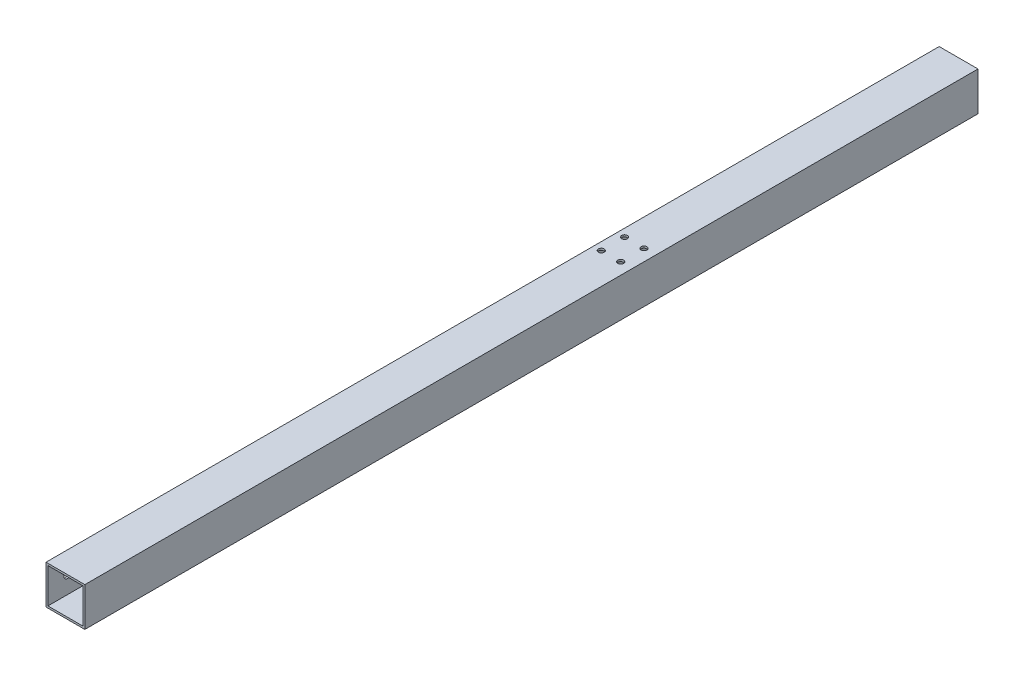
ISO-10303-21;
HEADER;
FILE_DESCRIPTION(('STEP AP214'),'2;1');
FILE_NAME('part.step','',(''),(''),'','','');
FILE_SCHEMA(('AUTOMOTIVE_DESIGN { 1 0 10303 214 1 1 1 1 }'));
ENDSEC;
DATA;
#1=APPLICATION_CONTEXT('core data for automotive mechanical design processes');
#2=APPLICATION_PROTOCOL_DEFINITION('international standard','automotive_design',2000,#1);
#3=PRODUCT_CONTEXT('',#1,'mechanical');
#4=PRODUCT('Part','Part','',(#3));
#5=PRODUCT_RELATED_PRODUCT_CATEGORY('part','',(#4));
#6=PRODUCT_DEFINITION_FORMATION('','',#4);
#7=PRODUCT_DEFINITION_CONTEXT('part definition',#1,'design');
#8=PRODUCT_DEFINITION('design','',#6,#7);
#9=PRODUCT_DEFINITION_SHAPE('','',#8);
#10=(LENGTH_UNIT() NAMED_UNIT(*) SI_UNIT(.MILLI.,.METRE.));
#11=(NAMED_UNIT(*) PLANE_ANGLE_UNIT() SI_UNIT($,.RADIAN.));
#12=(NAMED_UNIT(*) SI_UNIT($,.STERADIAN.) SOLID_ANGLE_UNIT());
#13=UNCERTAINTY_MEASURE_WITH_UNIT(LENGTH_MEASURE(1.E-05),#10,'distance_accuracy_value','');
#14=(GEOMETRIC_REPRESENTATION_CONTEXT(3) GLOBAL_UNCERTAINTY_ASSIGNED_CONTEXT((#13)) GLOBAL_UNIT_ASSIGNED_CONTEXT((#10,
#11,#12)) REPRESENTATION_CONTEXT('',''));
#15=CARTESIAN_POINT('',(0.,0.,0.));
#16=DIRECTION('',(0.,0.,1.));
#17=DIRECTION('',(1.,0.,0.));
#18=AXIS2_PLACEMENT_3D('',#15,#16,#17);
#19=CARTESIAN_POINT('',(0.,0.,460.));
#20=DIRECTION('',(0.,0.,1.));
#21=DIRECTION('',(1.,0.,0.));
#22=AXIS2_PLACEMENT_3D('',#19,#20,#21);
#23=PLANE('',#22);
#24=DIRECTION('',(0.,1.,0.));
#25=VECTOR('',#24,1.);
#26=CARTESIAN_POINT('',(10.,10.,460.));
#27=LINE('',#26,#25);
#28=CARTESIAN_POINT('',(10.,-10.,460.));
#29=VERTEX_POINT('',#28);
#30=CARTESIAN_POINT('',(10.,10.,460.));
#31=VERTEX_POINT('',#30);
#32=EDGE_CURVE('E143',#29,#31,#27,.T.);
#33=ORIENTED_EDGE('',*,*,#32,.T.);
#34=DIRECTION('',(-1.,0.,0.));
#35=VECTOR('',#34,1.);
#36=CARTESIAN_POINT('',(-10.,10.,460.));
#37=LINE('',#36,#35);
#38=CARTESIAN_POINT('',(-10.,10.,460.));
#39=VERTEX_POINT('',#38);
#40=EDGE_CURVE('E146',#31,#39,#37,.T.);
#41=ORIENTED_EDGE('',*,*,#40,.T.);
#42=DIRECTION('',(0.,-1.,0.));
#43=VECTOR('',#42,1.);
#44=CARTESIAN_POINT('',(-10.,10.,460.));
#45=LINE('',#44,#43);
#46=CARTESIAN_POINT('',(-10.,-10.,460.));
#47=VERTEX_POINT('',#46);
#48=EDGE_CURVE('E149',#39,#47,#45,.T.);
#49=ORIENTED_EDGE('',*,*,#48,.T.);
#50=DIRECTION('',(1.,0.,0.));
#51=VECTOR('',#50,1.);
#52=CARTESIAN_POINT('',(-10.,-10.,460.));
#53=LINE('',#52,#51);
#54=EDGE_CURVE('E151',#47,#29,#53,.T.);
#55=ORIENTED_EDGE('',*,*,#54,.T.);
#56=EDGE_LOOP('',(#33,#41,#49,#55));
#57=FACE_BOUND('',#56,.T.);
#58=DIRECTION('',(-1.,0.,0.));
#59=VECTOR('',#58,1.);
#60=CARTESIAN_POINT('',(-9.,9.,460.));
#61=LINE('',#60,#59);
#62=CARTESIAN_POINT('',(9.,9.,460.));
#63=VERTEX_POINT('',#62);
#64=CARTESIAN_POINT('',(-9.,9.,460.));
#65=VERTEX_POINT('',#64);
#66=EDGE_CURVE('E113',#63,#65,#61,.T.);
#67=ORIENTED_EDGE('',*,*,#66,.F.);
#68=DIRECTION('',(0.,1.,0.));
#69=VECTOR('',#68,1.);
#70=CARTESIAN_POINT('',(9.,9.,460.));
#71=LINE('',#70,#69);
#72=CARTESIAN_POINT('',(9.,-9.,460.));
#73=VERTEX_POINT('',#72);
#74=EDGE_CURVE('E105',#73,#63,#71,.T.);
#75=ORIENTED_EDGE('',*,*,#74,.F.);
#76=DIRECTION('',(1.,0.,0.));
#77=VECTOR('',#76,1.);
#78=CARTESIAN_POINT('',(-9.,-9.,460.));
#79=LINE('',#78,#77);
#80=CARTESIAN_POINT('',(-9.,-9.,460.));
#81=VERTEX_POINT('',#80);
#82=EDGE_CURVE('E127',#81,#73,#79,.T.);
#83=ORIENTED_EDGE('',*,*,#82,.F.);
#84=DIRECTION('',(0.,-1.,0.));
#85=VECTOR('',#84,1.);
#86=CARTESIAN_POINT('',(-9.,9.,460.));
#87=LINE('',#86,#85);
#88=EDGE_CURVE('E125',#65,#81,#87,.T.);
#89=ORIENTED_EDGE('',*,*,#88,.F.);
#90=EDGE_LOOP('',(#67,#75,#83,#89));
#91=FACE_BOUND('',#90,.T.);
#92=ADVANCED_FACE('F38',(#57,#91),#23,.T.);
#93=CARTESIAN_POINT('',(0.,0.,0.));
#94=DIRECTION('',(0.,0.,1.));
#95=DIRECTION('',(1.,0.,0.));
#96=AXIS2_PLACEMENT_3D('',#93,#94,#95);
#97=PLANE('',#96);
#98=DIRECTION('',(0.,1.,0.));
#99=VECTOR('',#98,1.);
#100=CARTESIAN_POINT('',(10.,10.,0.));
#101=LINE('',#100,#99);
#102=CARTESIAN_POINT('',(10.,-10.,0.));
#103=VERTEX_POINT('',#102);
#104=CARTESIAN_POINT('',(10.,10.,0.));
#105=VERTEX_POINT('',#104);
#106=EDGE_CURVE('E121',#103,#105,#101,.T.);
#107=ORIENTED_EDGE('',*,*,#106,.F.);
#108=DIRECTION('',(1.,0.,0.));
#109=VECTOR('',#108,1.);
#110=CARTESIAN_POINT('',(-10.,-10.,0.));
#111=LINE('',#110,#109);
#112=CARTESIAN_POINT('',(-10.,-10.,0.));
#113=VERTEX_POINT('',#112);
#114=EDGE_CURVE('E147',#113,#103,#111,.T.);
#115=ORIENTED_EDGE('',*,*,#114,.F.);
#116=DIRECTION('',(0.,-1.,0.));
#117=VECTOR('',#116,1.);
#118=CARTESIAN_POINT('',(-10.,10.,0.));
#119=LINE('',#118,#117);
#120=CARTESIAN_POINT('',(-10.,10.,0.));
#121=VERTEX_POINT('',#120);
#122=EDGE_CURVE('E158',#121,#113,#119,.T.);
#123=ORIENTED_EDGE('',*,*,#122,.F.);
#124=DIRECTION('',(-1.,0.,0.));
#125=VECTOR('',#124,1.);
#126=CARTESIAN_POINT('',(-10.,10.,0.));
#127=LINE('',#126,#125);
#128=EDGE_CURVE('E156',#105,#121,#127,.T.);
#129=ORIENTED_EDGE('',*,*,#128,.F.);
#130=EDGE_LOOP('',(#107,#115,#123,#129));
#131=FACE_BOUND('',#130,.T.);
#132=DIRECTION('',(0.,1.,0.));
#133=VECTOR('',#132,1.);
#134=CARTESIAN_POINT('',(9.,9.,0.));
#135=LINE('',#134,#133);
#136=CARTESIAN_POINT('',(9.,-9.,0.));
#137=VERTEX_POINT('',#136);
#138=CARTESIAN_POINT('',(9.,9.,0.));
#139=VERTEX_POINT('',#138);
#140=EDGE_CURVE('E63',#137,#139,#135,.T.);
#141=ORIENTED_EDGE('',*,*,#140,.T.);
#142=DIRECTION('',(-1.,0.,0.));
#143=VECTOR('',#142,1.);
#144=CARTESIAN_POINT('',(-9.,9.,0.));
#145=LINE('',#144,#143);
#146=CARTESIAN_POINT('',(-9.,9.,0.));
#147=VERTEX_POINT('',#146);
#148=EDGE_CURVE('E120',#139,#147,#145,.T.);
#149=ORIENTED_EDGE('',*,*,#148,.T.);
#150=DIRECTION('',(0.,-1.,0.));
#151=VECTOR('',#150,1.);
#152=CARTESIAN_POINT('',(-9.,9.,0.));
#153=LINE('',#152,#151);
#154=CARTESIAN_POINT('',(-9.,-9.,0.));
#155=VERTEX_POINT('',#154);
#156=EDGE_CURVE('E135',#147,#155,#153,.T.);
#157=ORIENTED_EDGE('',*,*,#156,.T.);
#158=DIRECTION('',(1.,0.,0.));
#159=VECTOR('',#158,1.);
#160=CARTESIAN_POINT('',(-9.,-9.,0.));
#161=LINE('',#160,#159);
#162=EDGE_CURVE('E114',#155,#137,#161,.T.);
#163=ORIENTED_EDGE('',*,*,#162,.T.);
#164=EDGE_LOOP('',(#141,#149,#157,#163));
#165=FACE_BOUND('',#164,.T.);
#166=ADVANCED_FACE('F235',(#131,#165),#97,.F.);
#167=CARTESIAN_POINT('',(10.,10.,460.));
#168=DIRECTION('',(-1.,0.,0.));
#169=DIRECTION('',(0.,0.,1.));
#170=AXIS2_PLACEMENT_3D('',#167,#168,#169);
#171=PLANE('',#170);
#172=ORIENTED_EDGE('',*,*,#106,.T.);
#173=DIRECTION('',(0.,0.,-1.));
#174=VECTOR('',#173,1.);
#175=CARTESIAN_POINT('',(10.,10.,460.));
#176=LINE('',#175,#174);
#177=EDGE_CURVE('E11',#31,#105,#176,.T.);
#178=ORIENTED_EDGE('',*,*,#177,.F.);
#179=ORIENTED_EDGE('',*,*,#32,.F.);
#180=DIRECTION('',(0.,0.,-1.));
#181=VECTOR('',#180,1.);
#182=CARTESIAN_POINT('',(10.,-10.,460.));
#183=LINE('',#182,#181);
#184=EDGE_CURVE('E153',#29,#103,#183,.T.);
#185=ORIENTED_EDGE('',*,*,#184,.T.);
#186=EDGE_LOOP('',(#172,#178,#179,#185));
#187=FACE_BOUND('',#186,.T.);
#188=ADVANCED_FACE('F40',(#187),#171,.F.);
#189=CARTESIAN_POINT('',(-10.,10.,460.));
#190=DIRECTION('',(0.,-1.,0.));
#191=DIRECTION('',(0.,0.,-1.));
#192=AXIS2_PLACEMENT_3D('',#189,#190,#191);
#193=PLANE('',#192);
#194=CARTESIAN_POINT('',(-6.00000000000231,10.,166.000000000001));
#195=DIRECTION('',(0.,1.,0.));
#196=DIRECTION('',(0.,0.,1.));
#197=AXIS2_PLACEMENT_3D('',#194,#195,#196);
#198=CIRCLE('',#197,1.50000000000001);
#199=CARTESIAN_POINT('',(-6.00000000000231,10.,167.500000000001));
#200=VERTEX_POINT('',#199);
#201=EDGE_CURVE('E288',#200,#200,#198,.T.);
#202=ORIENTED_EDGE('',*,*,#201,.F.);
#203=EDGE_LOOP('',(#202));
#204=FACE_BOUND('',#203,.T.);
#205=CARTESIAN_POINT('',(3.99999999999769,10.,178.000000000001));
#206=DIRECTION('',(0.,1.,0.));
#207=DIRECTION('',(0.,0.,1.));
#208=AXIS2_PLACEMENT_3D('',#205,#206,#207);
#209=CIRCLE('',#208,1.5);
#210=CARTESIAN_POINT('',(3.99999999999769,10.,179.500000000001));
#211=VERTEX_POINT('',#210);
#212=EDGE_CURVE('E284',#211,#211,#209,.T.);
#213=ORIENTED_EDGE('',*,*,#212,.F.);
#214=EDGE_LOOP('',(#213));
#215=FACE_BOUND('',#214,.T.);
#216=CARTESIAN_POINT('',(-6.00000000000231,10.,178.000000000001));
#217=DIRECTION('',(0.,1.,0.));
#218=DIRECTION('',(0.,0.,1.));
#219=AXIS2_PLACEMENT_3D('',#216,#217,#218);
#220=CIRCLE('',#219,1.5);
#221=CARTESIAN_POINT('',(-6.00000000000231,10.,179.500000000001));
#222=VERTEX_POINT('',#221);
#223=EDGE_CURVE('E292',#222,#222,#220,.T.);
#224=ORIENTED_EDGE('',*,*,#223,.F.);
#225=EDGE_LOOP('',(#224));
#226=FACE_BOUND('',#225,.T.);
#227=CARTESIAN_POINT('',(3.99999999999769,10.,166.000000000001));
#228=DIRECTION('',(0.,1.,0.));
#229=DIRECTION('',(0.,0.,1.));
#230=AXIS2_PLACEMENT_3D('',#227,#228,#229);
#231=CIRCLE('',#230,1.50000000000001);
#232=CARTESIAN_POINT('',(3.99999999999769,10.,167.500000000001));
#233=VERTEX_POINT('',#232);
#234=EDGE_CURVE('E280',#233,#233,#231,.T.);
#235=ORIENTED_EDGE('',*,*,#234,.F.);
#236=EDGE_LOOP('',(#235));
#237=FACE_BOUND('',#236,.T.);
#238=ORIENTED_EDGE('',*,*,#128,.T.);
#239=DIRECTION('',(0.,0.,-1.));
#240=VECTOR('',#239,1.);
#241=CARTESIAN_POINT('',(-10.,10.,460.));
#242=LINE('',#241,#240);
#243=EDGE_CURVE('E47',#39,#121,#242,.T.);
#244=ORIENTED_EDGE('',*,*,#243,.F.);
#245=ORIENTED_EDGE('',*,*,#40,.F.);
#246=ORIENTED_EDGE('',*,*,#177,.T.);
#247=EDGE_LOOP('',(#238,#244,#245,#246));
#248=FACE_BOUND('',#247,.T.);
#249=ADVANCED_FACE('F222',(#204,#215,#226,#237,#248),#193,.F.);
#250=CARTESIAN_POINT('',(-10.,10.,460.));
#251=DIRECTION('',(1.,0.,0.));
#252=DIRECTION('',(0.,1.,0.));
#253=AXIS2_PLACEMENT_3D('',#250,#251,#252);
#254=PLANE('',#253);
#255=CARTESIAN_POINT('',(-10.,0.,262.));
#256=DIRECTION('',(-1.,0.,0.));
#257=DIRECTION('',(0.,-1.,0.));
#258=AXIS2_PLACEMENT_3D('',#255,#256,#257);
#259=CIRCLE('',#258,1.80000000000001);
#260=CARTESIAN_POINT('',(-10.,-1.80000000000001,262.));
#261=VERTEX_POINT('',#260);
#262=EDGE_CURVE('E182',#261,#261,#259,.T.);
#263=ORIENTED_EDGE('',*,*,#262,.F.);
#264=EDGE_LOOP('',(#263));
#265=FACE_BOUND('',#264,.T.);
#266=CARTESIAN_POINT('',(-10.,0.,450.));
#267=DIRECTION('',(-1.,0.,0.));
#268=DIRECTION('',(0.,-1.,0.));
#269=AXIS2_PLACEMENT_3D('',#266,#267,#268);
#270=CIRCLE('',#269,1.80000000000001);
#271=CARTESIAN_POINT('',(-10.,-1.80000000000001,450.));
#272=VERTEX_POINT('',#271);
#273=EDGE_CURVE('E178',#272,#272,#270,.T.);
#274=ORIENTED_EDGE('',*,*,#273,.F.);
#275=EDGE_LOOP('',(#274));
#276=FACE_BOUND('',#275,.T.);
#277=CARTESIAN_POINT('',(-10.,0.,198.));
#278=DIRECTION('',(-1.,0.,0.));
#279=DIRECTION('',(0.,-1.,0.));
#280=AXIS2_PLACEMENT_3D('',#277,#278,#279);
#281=CIRCLE('',#280,1.80000000000001);
#282=CARTESIAN_POINT('',(-10.,-1.80000000000001,198.));
#283=VERTEX_POINT('',#282);
#284=EDGE_CURVE('E174',#283,#283,#281,.T.);
#285=ORIENTED_EDGE('',*,*,#284,.F.);
#286=EDGE_LOOP('',(#285));
#287=FACE_BOUND('',#286,.T.);
#288=CARTESIAN_POINT('',(-10.,0.,10.));
#289=DIRECTION('',(-1.,0.,0.));
#290=DIRECTION('',(0.,-1.,0.));
#291=AXIS2_PLACEMENT_3D('',#288,#289,#290);
#292=CIRCLE('',#291,1.8);
#293=CARTESIAN_POINT('',(-10.,-1.8,10.));
#294=VERTEX_POINT('',#293);
#295=EDGE_CURVE('E170',#294,#294,#292,.T.);
#296=ORIENTED_EDGE('',*,*,#295,.F.);
#297=EDGE_LOOP('',(#296));
#298=FACE_BOUND('',#297,.T.);
#299=ORIENTED_EDGE('',*,*,#122,.T.);
#300=DIRECTION('',(0.,0.,-1.));
#301=VECTOR('',#300,1.);
#302=CARTESIAN_POINT('',(-10.,-10.,460.));
#303=LINE('',#302,#301);
#304=EDGE_CURVE('E163',#47,#113,#303,.T.);
#305=ORIENTED_EDGE('',*,*,#304,.F.);
#306=ORIENTED_EDGE('',*,*,#48,.F.);
#307=ORIENTED_EDGE('',*,*,#243,.T.);
#308=EDGE_LOOP('',(#299,#305,#306,#307));
#309=FACE_BOUND('',#308,.T.);
#310=ADVANCED_FACE('F218',(#265,#276,#287,#298,#309),#254,.F.);
#311=CARTESIAN_POINT('',(-10.,-10.,460.));
#312=DIRECTION('',(0.,1.,0.));
#313=DIRECTION('',(0.,0.,1.));
#314=AXIS2_PLACEMENT_3D('',#311,#312,#313);
#315=PLANE('',#314);
#316=CARTESIAN_POINT('',(-6.00000000000231,-10.,166.000000000001));
#317=DIRECTION('',(0.,1.,0.));
#318=DIRECTION('',(0.,0.,1.));
#319=AXIS2_PLACEMENT_3D('',#316,#317,#318);
#320=CIRCLE('',#319,1.50000000000001);
#321=CARTESIAN_POINT('',(-6.00000000000231,-10.,167.500000000001));
#322=VERTEX_POINT('',#321);
#323=EDGE_CURVE('E268',#322,#322,#320,.T.);
#324=ORIENTED_EDGE('',*,*,#323,.T.);
#325=EDGE_LOOP('',(#324));
#326=FACE_BOUND('',#325,.T.);
#327=CARTESIAN_POINT('',(3.99999999999769,-10.,178.000000000001));
#328=DIRECTION('',(0.,1.,0.));
#329=DIRECTION('',(0.,0.,1.));
#330=AXIS2_PLACEMENT_3D('',#327,#328,#329);
#331=CIRCLE('',#330,1.5);
#332=CARTESIAN_POINT('',(3.99999999999769,-10.,179.500000000001));
#333=VERTEX_POINT('',#332);
#334=EDGE_CURVE('E272',#333,#333,#331,.T.);
#335=ORIENTED_EDGE('',*,*,#334,.T.);
#336=EDGE_LOOP('',(#335));
#337=FACE_BOUND('',#336,.T.);
#338=CARTESIAN_POINT('',(-6.00000000000231,-10.,178.000000000001));
#339=DIRECTION('',(0.,1.,0.));
#340=DIRECTION('',(0.,0.,1.));
#341=AXIS2_PLACEMENT_3D('',#338,#339,#340);
#342=CIRCLE('',#341,1.5);
#343=CARTESIAN_POINT('',(-6.00000000000231,-10.,179.500000000001));
#344=VERTEX_POINT('',#343);
#345=EDGE_CURVE('E276',#344,#344,#342,.T.);
#346=ORIENTED_EDGE('',*,*,#345,.T.);
#347=EDGE_LOOP('',(#346));
#348=FACE_BOUND('',#347,.T.);
#349=CARTESIAN_POINT('',(3.99999999999769,-10.,166.000000000001));
#350=DIRECTION('',(0.,1.,0.));
#351=DIRECTION('',(0.,0.,1.));
#352=AXIS2_PLACEMENT_3D('',#349,#350,#351);
#353=CIRCLE('',#352,1.50000000000001);
#354=CARTESIAN_POINT('',(3.99999999999769,-10.,167.500000000001));
#355=VERTEX_POINT('',#354);
#356=EDGE_CURVE('E187',#355,#355,#353,.T.);
#357=ORIENTED_EDGE('',*,*,#356,.T.);
#358=EDGE_LOOP('',(#357));
#359=FACE_BOUND('',#358,.T.);
#360=ORIENTED_EDGE('',*,*,#114,.T.);
#361=ORIENTED_EDGE('',*,*,#184,.F.);
#362=ORIENTED_EDGE('',*,*,#54,.F.);
#363=ORIENTED_EDGE('',*,*,#304,.T.);
#364=EDGE_LOOP('',(#360,#361,#362,#363));
#365=FACE_BOUND('',#364,.T.);
#366=ADVANCED_FACE('F221',(#326,#337,#348,#359,#365),#315,.F.);
#367=CARTESIAN_POINT('',(9.,9.,460.));
#368=DIRECTION('',(-1.,0.,0.));
#369=DIRECTION('',(0.,0.,1.));
#370=AXIS2_PLACEMENT_3D('',#367,#368,#369);
#371=PLANE('',#370);
#372=ORIENTED_EDGE('',*,*,#140,.F.);
#373=DIRECTION('',(0.,0.,-1.));
#374=VECTOR('',#373,1.);
#375=CARTESIAN_POINT('',(9.,-9.,460.));
#376=LINE('',#375,#374);
#377=EDGE_CURVE('E109',#73,#137,#376,.T.);
#378=ORIENTED_EDGE('',*,*,#377,.F.);
#379=ORIENTED_EDGE('',*,*,#74,.T.);
#380=DIRECTION('',(0.,0.,-1.));
#381=VECTOR('',#380,1.);
#382=CARTESIAN_POINT('',(9.,9.,460.));
#383=LINE('',#382,#381);
#384=EDGE_CURVE('E108',#63,#139,#383,.T.);
#385=ORIENTED_EDGE('',*,*,#384,.T.);
#386=EDGE_LOOP('',(#372,#378,#379,#385));
#387=FACE_BOUND('',#386,.T.);
#388=ADVANCED_FACE('F107',(#387),#371,.T.);
#389=CARTESIAN_POINT('',(-9.,9.,460.));
#390=DIRECTION('',(0.,-1.,0.));
#391=DIRECTION('',(0.,0.,-1.));
#392=AXIS2_PLACEMENT_3D('',#389,#390,#391);
#393=PLANE('',#392);
#394=CARTESIAN_POINT('',(-6.00000000000231,9.,166.000000000001));
#395=DIRECTION('',(0.,-1.,0.));
#396=DIRECTION('',(0.,0.,-1.));
#397=AXIS2_PLACEMENT_3D('',#394,#395,#396);
#398=CIRCLE('',#397,1.50000000000001);
#399=CARTESIAN_POINT('',(-6.00000000000231,9.,164.500000000001));
#400=VERTEX_POINT('',#399);
#401=EDGE_CURVE('E205',#400,#400,#398,.T.);
#402=ORIENTED_EDGE('',*,*,#401,.F.);
#403=EDGE_LOOP('',(#402));
#404=FACE_BOUND('',#403,.T.);
#405=CARTESIAN_POINT('',(3.99999999999769,9.,178.000000000001));
#406=DIRECTION('',(0.,-1.,0.));
#407=DIRECTION('',(0.,0.,-1.));
#408=AXIS2_PLACEMENT_3D('',#405,#406,#407);
#409=CIRCLE('',#408,1.5);
#410=CARTESIAN_POINT('',(3.99999999999769,9.,176.500000000001));
#411=VERTEX_POINT('',#410);
#412=EDGE_CURVE('E193',#411,#411,#409,.T.);
#413=ORIENTED_EDGE('',*,*,#412,.F.);
#414=EDGE_LOOP('',(#413));
#415=FACE_BOUND('',#414,.T.);
#416=CARTESIAN_POINT('',(-6.00000000000231,9.,178.000000000001));
#417=DIRECTION('',(0.,-1.,0.));
#418=DIRECTION('',(0.,0.,-1.));
#419=AXIS2_PLACEMENT_3D('',#416,#417,#418);
#420=CIRCLE('',#419,1.5);
#421=CARTESIAN_POINT('',(-6.00000000000231,9.,176.500000000001));
#422=VERTEX_POINT('',#421);
#423=EDGE_CURVE('E190',#422,#422,#420,.T.);
#424=ORIENTED_EDGE('',*,*,#423,.F.);
#425=EDGE_LOOP('',(#424));
#426=FACE_BOUND('',#425,.T.);
#427=CARTESIAN_POINT('',(3.99999999999769,9.,166.000000000001));
#428=DIRECTION('',(0.,-1.,0.));
#429=DIRECTION('',(0.,0.,-1.));
#430=AXIS2_PLACEMENT_3D('',#427,#428,#429);
#431=CIRCLE('',#430,1.50000000000001);
#432=CARTESIAN_POINT('',(3.99999999999769,9.,164.500000000001));
#433=VERTEX_POINT('',#432);
#434=EDGE_CURVE('E186',#433,#433,#431,.T.);
#435=ORIENTED_EDGE('',*,*,#434,.F.);
#436=EDGE_LOOP('',(#435));
#437=FACE_BOUND('',#436,.T.);
#438=ORIENTED_EDGE('',*,*,#148,.F.);
#439=ORIENTED_EDGE('',*,*,#384,.F.);
#440=ORIENTED_EDGE('',*,*,#66,.T.);
#441=DIRECTION('',(0.,0.,-1.));
#442=VECTOR('',#441,1.);
#443=CARTESIAN_POINT('',(-9.,9.,460.));
#444=LINE('',#443,#442);
#445=EDGE_CURVE('E122',#65,#147,#444,.T.);
#446=ORIENTED_EDGE('',*,*,#445,.T.);
#447=EDGE_LOOP('',(#438,#439,#440,#446));
#448=FACE_BOUND('',#447,.T.);
#449=ADVANCED_FACE('F117',(#404,#415,#426,#437,#448),#393,.T.);
#450=CARTESIAN_POINT('',(-9.,9.,460.));
#451=DIRECTION('',(1.,0.,0.));
#452=DIRECTION('',(0.,0.,-1.));
#453=AXIS2_PLACEMENT_3D('',#450,#451,#452);
#454=PLANE('',#453);
#455=CARTESIAN_POINT('',(-9.,0.,262.));
#456=DIRECTION('',(1.,0.,0.));
#457=DIRECTION('',(0.,0.,-1.));
#458=AXIS2_PLACEMENT_3D('',#455,#456,#457);
#459=CIRCLE('',#458,1.80000000000001);
#460=CARTESIAN_POINT('',(-9.,0.,260.2));
#461=VERTEX_POINT('',#460);
#462=EDGE_CURVE('E179',#461,#461,#459,.T.);
#463=ORIENTED_EDGE('',*,*,#462,.F.);
#464=EDGE_LOOP('',(#463));
#465=FACE_BOUND('',#464,.T.);
#466=CARTESIAN_POINT('',(-9.,0.,450.));
#467=DIRECTION('',(1.,0.,0.));
#468=DIRECTION('',(0.,0.,-1.));
#469=AXIS2_PLACEMENT_3D('',#466,#467,#468);
#470=CIRCLE('',#469,1.80000000000001);
#471=CARTESIAN_POINT('',(-9.,0.,448.2));
#472=VERTEX_POINT('',#471);
#473=EDGE_CURVE('E175',#472,#472,#470,.T.);
#474=ORIENTED_EDGE('',*,*,#473,.F.);
#475=EDGE_LOOP('',(#474));
#476=FACE_BOUND('',#475,.T.);
#477=CARTESIAN_POINT('',(-9.,0.,198.));
#478=DIRECTION('',(1.,0.,0.));
#479=DIRECTION('',(0.,0.,-1.));
#480=AXIS2_PLACEMENT_3D('',#477,#478,#479);
#481=CIRCLE('',#480,1.80000000000001);
#482=CARTESIAN_POINT('',(-9.,0.,196.2));
#483=VERTEX_POINT('',#482);
#484=EDGE_CURVE('E171',#483,#483,#481,.T.);
#485=ORIENTED_EDGE('',*,*,#484,.F.);
#486=EDGE_LOOP('',(#485));
#487=FACE_BOUND('',#486,.T.);
#488=CARTESIAN_POINT('',(-9.,0.,10.));
#489=DIRECTION('',(1.,0.,0.));
#490=DIRECTION('',(0.,0.,-1.));
#491=AXIS2_PLACEMENT_3D('',#488,#489,#490);
#492=CIRCLE('',#491,1.8);
#493=CARTESIAN_POINT('',(-9.,0.,8.2));
#494=VERTEX_POINT('',#493);
#495=EDGE_CURVE('E133',#494,#494,#492,.T.);
#496=ORIENTED_EDGE('',*,*,#495,.F.);
#497=EDGE_LOOP('',(#496));
#498=FACE_BOUND('',#497,.T.);
#499=ORIENTED_EDGE('',*,*,#156,.F.);
#500=ORIENTED_EDGE('',*,*,#445,.F.);
#501=ORIENTED_EDGE('',*,*,#88,.T.);
#502=DIRECTION('',(0.,0.,-1.));
#503=VECTOR('',#502,1.);
#504=CARTESIAN_POINT('',(-9.,-9.,460.));
#505=LINE('',#504,#503);
#506=EDGE_CURVE('E55',#81,#155,#505,.T.);
#507=ORIENTED_EDGE('',*,*,#506,.T.);
#508=EDGE_LOOP('',(#499,#500,#501,#507));
#509=FACE_BOUND('',#508,.T.);
#510=ADVANCED_FACE('F336',(#465,#476,#487,#498,#509),#454,.T.);
#511=CARTESIAN_POINT('',(-9.,-9.,460.));
#512=DIRECTION('',(0.,1.,0.));
#513=DIRECTION('',(0.,0.,1.));
#514=AXIS2_PLACEMENT_3D('',#511,#512,#513);
#515=PLANE('',#514);
#516=CARTESIAN_POINT('',(-6.00000000000231,-9.,166.000000000001));
#517=DIRECTION('',(0.,1.,0.));
#518=DIRECTION('',(0.,0.,1.));
#519=AXIS2_PLACEMENT_3D('',#516,#517,#518);
#520=CIRCLE('',#519,1.50000000000001);
#521=CARTESIAN_POINT('',(-6.00000000000231,-9.,167.500000000001));
#522=VERTEX_POINT('',#521);
#523=EDGE_CURVE('E42',#522,#522,#520,.T.);
#524=ORIENTED_EDGE('',*,*,#523,.F.);
#525=EDGE_LOOP('',(#524));
#526=FACE_BOUND('',#525,.T.);
#527=CARTESIAN_POINT('',(3.99999999999769,-9.,178.000000000001));
#528=DIRECTION('',(0.,1.,0.));
#529=DIRECTION('',(0.,0.,1.));
#530=AXIS2_PLACEMENT_3D('',#527,#528,#529);
#531=CIRCLE('',#530,1.5);
#532=CARTESIAN_POINT('',(3.99999999999769,-9.,179.500000000001));
#533=VERTEX_POINT('',#532);
#534=EDGE_CURVE('E191',#533,#533,#531,.T.);
#535=ORIENTED_EDGE('',*,*,#534,.F.);
#536=EDGE_LOOP('',(#535));
#537=FACE_BOUND('',#536,.T.);
#538=CARTESIAN_POINT('',(-6.00000000000231,-9.,178.000000000001));
#539=DIRECTION('',(0.,1.,0.));
#540=DIRECTION('',(0.,0.,1.));
#541=AXIS2_PLACEMENT_3D('',#538,#539,#540);
#542=CIRCLE('',#541,1.5);
#543=CARTESIAN_POINT('',(-6.00000000000231,-9.,179.500000000001));
#544=VERTEX_POINT('',#543);
#545=EDGE_CURVE('E188',#544,#544,#542,.T.);
#546=ORIENTED_EDGE('',*,*,#545,.F.);
#547=EDGE_LOOP('',(#546));
#548=FACE_BOUND('',#547,.T.);
#549=CARTESIAN_POINT('',(3.99999999999769,-9.,166.000000000001));
#550=DIRECTION('',(0.,1.,0.));
#551=DIRECTION('',(0.,0.,1.));
#552=AXIS2_PLACEMENT_3D('',#549,#550,#551);
#553=CIRCLE('',#552,1.50000000000001);
#554=CARTESIAN_POINT('',(3.99999999999769,-9.,167.500000000001));
#555=VERTEX_POINT('',#554);
#556=EDGE_CURVE('E183',#555,#555,#553,.T.);
#557=ORIENTED_EDGE('',*,*,#556,.F.);
#558=EDGE_LOOP('',(#557));
#559=FACE_BOUND('',#558,.T.);
#560=ORIENTED_EDGE('',*,*,#162,.F.);
#561=ORIENTED_EDGE('',*,*,#506,.F.);
#562=ORIENTED_EDGE('',*,*,#82,.T.);
#563=ORIENTED_EDGE('',*,*,#377,.T.);
#564=EDGE_LOOP('',(#560,#561,#562,#563));
#565=FACE_BOUND('',#564,.T.);
#566=ADVANCED_FACE('F334',(#526,#537,#548,#559,#565),#515,.T.);
#567=CARTESIAN_POINT('',(-7.,0.,10.));
#568=DIRECTION('',(-1.,0.,0.));
#569=DIRECTION('',(0.,-1.,0.));
#570=AXIS2_PLACEMENT_3D('',#567,#568,#569);
#571=CYLINDRICAL_SURFACE('',#570,1.8);
#572=ORIENTED_EDGE('',*,*,#495,.T.);
#573=EDGE_LOOP('',(#572));
#574=FACE_BOUND('',#573,.T.);
#575=ORIENTED_EDGE('',*,*,#295,.T.);
#576=EDGE_LOOP('',(#575));
#577=FACE_BOUND('',#576,.T.);
#578=ADVANCED_FACE('F216',(#574,#577),#571,.F.);
#579=CARTESIAN_POINT('',(-7.,0.,198.));
#580=DIRECTION('',(-1.,0.,0.));
#581=DIRECTION('',(0.,-1.,0.));
#582=AXIS2_PLACEMENT_3D('',#579,#580,#581);
#583=CYLINDRICAL_SURFACE('',#582,1.80000000000001);
#584=ORIENTED_EDGE('',*,*,#484,.T.);
#585=EDGE_LOOP('',(#584));
#586=FACE_BOUND('',#585,.T.);
#587=ORIENTED_EDGE('',*,*,#284,.T.);
#588=EDGE_LOOP('',(#587));
#589=FACE_BOUND('',#588,.T.);
#590=ADVANCED_FACE('F352',(#586,#589),#583,.F.);
#591=CARTESIAN_POINT('',(-7.,0.,450.));
#592=DIRECTION('',(-1.,0.,0.));
#593=DIRECTION('',(0.,-1.,0.));
#594=AXIS2_PLACEMENT_3D('',#591,#592,#593);
#595=CYLINDRICAL_SURFACE('',#594,1.80000000000001);
#596=ORIENTED_EDGE('',*,*,#473,.T.);
#597=EDGE_LOOP('',(#596));
#598=FACE_BOUND('',#597,.T.);
#599=ORIENTED_EDGE('',*,*,#273,.T.);
#600=EDGE_LOOP('',(#599));
#601=FACE_BOUND('',#600,.T.);
#602=ADVANCED_FACE('F330',(#598,#601),#595,.F.);
#603=CARTESIAN_POINT('',(0.,0.,262.));
#604=DIRECTION('',(-1.,0.,0.));
#605=DIRECTION('',(0.,-1.,0.));
#606=AXIS2_PLACEMENT_3D('',#603,#604,#605);
#607=CYLINDRICAL_SURFACE('',#606,1.80000000000001);
#608=ORIENTED_EDGE('',*,*,#462,.T.);
#609=EDGE_LOOP('',(#608));
#610=FACE_BOUND('',#609,.T.);
#611=ORIENTED_EDGE('',*,*,#262,.T.);
#612=EDGE_LOOP('',(#611));
#613=FACE_BOUND('',#612,.T.);
#614=ADVANCED_FACE('F323',(#610,#613),#607,.F.);
#615=CARTESIAN_POINT('',(3.99999999999769,-10.,166.000000000001));
#616=DIRECTION('',(0.,1.,0.));
#617=DIRECTION('',(0.,0.,1.));
#618=AXIS2_PLACEMENT_3D('',#615,#616,#617);
#619=CYLINDRICAL_SURFACE('',#618,1.50000000000001);
#620=ORIENTED_EDGE('',*,*,#556,.T.);
#621=EDGE_LOOP('',(#620));
#622=FACE_BOUND('',#621,.T.);
#623=ORIENTED_EDGE('',*,*,#356,.F.);
#624=EDGE_LOOP('',(#623));
#625=FACE_BOUND('',#624,.T.);
#626=ADVANCED_FACE('F307',(#622,#625),#619,.F.);
#627=CARTESIAN_POINT('',(-6.00000000000231,-10.,178.000000000001));
#628=DIRECTION('',(0.,1.,0.));
#629=DIRECTION('',(0.,0.,1.));
#630=AXIS2_PLACEMENT_3D('',#627,#628,#629);
#631=CYLINDRICAL_SURFACE('',#630,1.5);
#632=ORIENTED_EDGE('',*,*,#545,.T.);
#633=EDGE_LOOP('',(#632));
#634=FACE_BOUND('',#633,.T.);
#635=ORIENTED_EDGE('',*,*,#345,.F.);
#636=EDGE_LOOP('',(#635));
#637=FACE_BOUND('',#636,.T.);
#638=ADVANCED_FACE('F314',(#634,#637),#631,.F.);
#639=CARTESIAN_POINT('',(3.99999999999769,-10.,178.000000000001));
#640=DIRECTION('',(0.,1.,0.));
#641=DIRECTION('',(0.,0.,1.));
#642=AXIS2_PLACEMENT_3D('',#639,#640,#641);
#643=CYLINDRICAL_SURFACE('',#642,1.5);
#644=ORIENTED_EDGE('',*,*,#534,.T.);
#645=EDGE_LOOP('',(#644));
#646=FACE_BOUND('',#645,.T.);
#647=ORIENTED_EDGE('',*,*,#334,.F.);
#648=EDGE_LOOP('',(#647));
#649=FACE_BOUND('',#648,.T.);
#650=ADVANCED_FACE('F315',(#646,#649),#643,.F.);
#651=CARTESIAN_POINT('',(-6.00000000000231,-10.,166.000000000001));
#652=DIRECTION('',(0.,1.,0.));
#653=DIRECTION('',(0.,0.,1.));
#654=AXIS2_PLACEMENT_3D('',#651,#652,#653);
#655=CYLINDRICAL_SURFACE('',#654,1.50000000000001);
#656=ORIENTED_EDGE('',*,*,#523,.T.);
#657=EDGE_LOOP('',(#656));
#658=FACE_BOUND('',#657,.T.);
#659=ORIENTED_EDGE('',*,*,#323,.F.);
#660=EDGE_LOOP('',(#659));
#661=FACE_BOUND('',#660,.T.);
#662=ADVANCED_FACE('F304',(#658,#661),#655,.F.);
#663=ORIENTED_EDGE('',*,*,#434,.T.);
#664=EDGE_LOOP('',(#663));
#665=FACE_BOUND('',#664,.T.);
#666=ORIENTED_EDGE('',*,*,#234,.T.);
#667=EDGE_LOOP('',(#666));
#668=FACE_BOUND('',#667,.T.);
#669=ADVANCED_FACE('F302',(#665,#668),#619,.F.);
#670=ORIENTED_EDGE('',*,*,#423,.T.);
#671=EDGE_LOOP('',(#670));
#672=FACE_BOUND('',#671,.T.);
#673=ORIENTED_EDGE('',*,*,#223,.T.);
#674=EDGE_LOOP('',(#673));
#675=FACE_BOUND('',#674,.T.);
#676=ADVANCED_FACE('F297',(#672,#675),#631,.F.);
#677=ORIENTED_EDGE('',*,*,#412,.T.);
#678=EDGE_LOOP('',(#677));
#679=FACE_BOUND('',#678,.T.);
#680=ORIENTED_EDGE('',*,*,#212,.T.);
#681=EDGE_LOOP('',(#680));
#682=FACE_BOUND('',#681,.T.);
#683=ADVANCED_FACE('F312',(#679,#682),#643,.F.);
#684=ORIENTED_EDGE('',*,*,#401,.T.);
#685=EDGE_LOOP('',(#684));
#686=FACE_BOUND('',#685,.T.);
#687=ORIENTED_EDGE('',*,*,#201,.T.);
#688=EDGE_LOOP('',(#687));
#689=FACE_BOUND('',#688,.T.);
#690=ADVANCED_FACE('F318',(#686,#689),#655,.F.);
#691=CLOSED_SHELL('',(#92,#166,#188,#249,#310,#366,#388,#449,#510,#566,#578,#590,#602,#614,#626,
#638,#650,#662,#669,#676,#683,#690));
#692=MANIFOLD_SOLID_BREP('B2',#691);
#693=ADVANCED_BREP_SHAPE_REPRESENTATION('',(#18,#692),#14);
#694=SHAPE_DEFINITION_REPRESENTATION(#9,#693);
ENDSEC;
END-ISO-10303-21;
